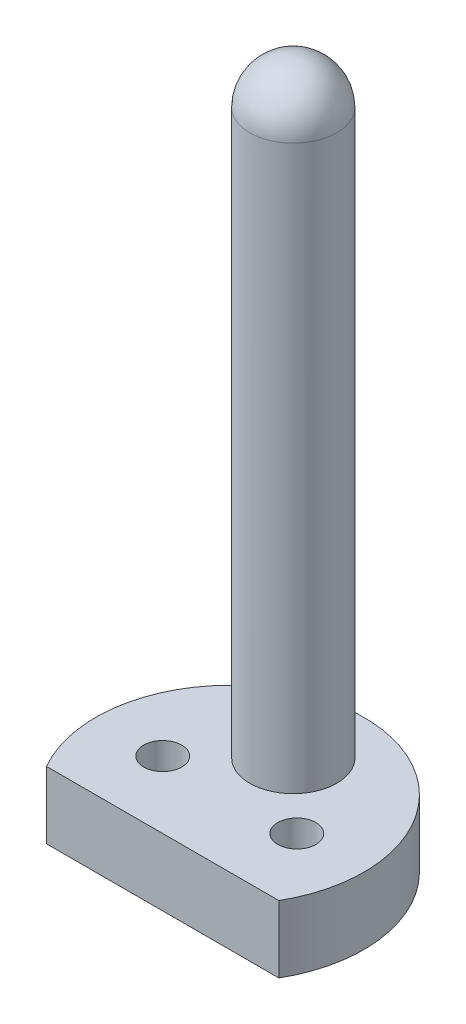
ISO-10303-21;
HEADER;
FILE_DESCRIPTION(('STEP AP214'),'2;1');
FILE_NAME('part.step','',(''),(''),'','','');
FILE_SCHEMA(('AUTOMOTIVE_DESIGN { 1 0 10303 214 1 1 1 1 }'));
ENDSEC;
DATA;
#1=APPLICATION_CONTEXT('core data for automotive mechanical design processes');
#2=APPLICATION_PROTOCOL_DEFINITION('international standard','automotive_design',2000,#1);
#3=PRODUCT_CONTEXT('',#1,'mechanical');
#4=PRODUCT('Part','Part','',(#3));
#5=PRODUCT_RELATED_PRODUCT_CATEGORY('part','',(#4));
#6=PRODUCT_DEFINITION_FORMATION('','',#4);
#7=PRODUCT_DEFINITION_CONTEXT('part definition',#1,'design');
#8=PRODUCT_DEFINITION('design','',#6,#7);
#9=PRODUCT_DEFINITION_SHAPE('','',#8);
#10=(LENGTH_UNIT() NAMED_UNIT(*) SI_UNIT(.MILLI.,.METRE.));
#11=(NAMED_UNIT(*) PLANE_ANGLE_UNIT() SI_UNIT($,.RADIAN.));
#12=(NAMED_UNIT(*) SI_UNIT($,.STERADIAN.) SOLID_ANGLE_UNIT());
#13=UNCERTAINTY_MEASURE_WITH_UNIT(LENGTH_MEASURE(1.E-05),#10,'distance_accuracy_value','');
#14=(GEOMETRIC_REPRESENTATION_CONTEXT(3) GLOBAL_UNCERTAINTY_ASSIGNED_CONTEXT((#13)) GLOBAL_UNIT_ASSIGNED_CONTEXT((#10,
#11,#12)) REPRESENTATION_CONTEXT('',''));
#15=CARTESIAN_POINT('',(0.,0.,0.));
#16=DIRECTION('',(0.,0.,1.));
#17=DIRECTION('',(1.,0.,0.));
#18=AXIS2_PLACEMENT_3D('',#15,#16,#17);
#19=CARTESIAN_POINT('',(0.,5.,0.));
#20=DIRECTION('',(0.,1.,0.));
#21=DIRECTION('',(0.,0.,1.));
#22=AXIS2_PLACEMENT_3D('',#19,#20,#21);
#23=PLANE('',#22);
#24=CARTESIAN_POINT('',(0.,5.,-4.73478223723896));
#25=DIRECTION('',(0.,1.,0.));
#26=DIRECTION('',(0.,0.,1.));
#27=AXIS2_PLACEMENT_3D('',#24,#25,#26);
#28=CIRCLE('',#27,3.25);
#29=CARTESIAN_POINT('',(0.,5.,-7.98478223723896));
#30=VERTEX_POINT('',#29);
#31=EDGE_CURVE('E89',#30,#30,#28,.T.);
#32=ORIENTED_EDGE('',*,*,#31,.F.);
#33=EDGE_LOOP('',(#32));
#34=FACE_BOUND('',#33,.T.);
#35=CARTESIAN_POINT('',(-5.,5.,0.));
#36=DIRECTION('',(0.,1.,0.));
#37=DIRECTION('',(0.,0.,1.));
#38=AXIS2_PLACEMENT_3D('',#35,#36,#37);
#39=CIRCLE('',#38,1.42);
#40=CARTESIAN_POINT('',(-5.,5.,1.42));
#41=VERTEX_POINT('',#40);
#42=EDGE_CURVE('E72',#41,#41,#39,.T.);
#43=ORIENTED_EDGE('',*,*,#42,.F.);
#44=EDGE_LOOP('',(#43));
#45=FACE_BOUND('',#44,.T.);
#46=CARTESIAN_POINT('',(0.,5.,0.));
#47=DIRECTION('',(0.,1.,0.));
#48=DIRECTION('',(0.,0.,1.));
#49=AXIS2_PLACEMENT_3D('',#46,#47,#48);
#50=CIRCLE('',#49,10.);
#51=CARTESIAN_POINT('',(8.66025403784439,5.,5.));
#52=VERTEX_POINT('',#51);
#53=CARTESIAN_POINT('',(-8.66025403784439,5.,5.));
#54=VERTEX_POINT('',#53);
#55=EDGE_CURVE('E66',#52,#54,#50,.T.);
#56=ORIENTED_EDGE('',*,*,#55,.T.);
#57=DIRECTION('',(1.,0.,0.));
#58=VECTOR('',#57,1.);
#59=CARTESIAN_POINT('',(-8.66025403784439,5.,5.));
#60=LINE('',#59,#58);
#61=EDGE_CURVE('E51',#54,#52,#60,.T.);
#62=ORIENTED_EDGE('',*,*,#61,.T.);
#63=EDGE_LOOP('',(#56,#62));
#64=FACE_BOUND('',#63,.T.);
#65=CARTESIAN_POINT('',(5.,5.,0.));
#66=DIRECTION('',(0.,1.,0.));
#67=DIRECTION('',(0.,0.,1.));
#68=AXIS2_PLACEMENT_3D('',#65,#66,#67);
#69=CIRCLE('',#68,1.42);
#70=CARTESIAN_POINT('',(5.,5.,1.42));
#71=VERTEX_POINT('',#70);
#72=EDGE_CURVE('E81',#71,#71,#69,.T.);
#73=ORIENTED_EDGE('',*,*,#72,.F.);
#74=EDGE_LOOP('',(#73));
#75=FACE_BOUND('',#74,.T.);
#76=ADVANCED_FACE('F35',(#34,#45,#64,#75),#23,.T.);
#77=CARTESIAN_POINT('',(0.,0.,0.));
#78=DIRECTION('',(0.,1.,0.));
#79=DIRECTION('',(0.,0.,1.));
#80=AXIS2_PLACEMENT_3D('',#77,#78,#79);
#81=PLANE('',#80);
#82=CARTESIAN_POINT('',(0.,0.,0.));
#83=DIRECTION('',(0.,1.,0.));
#84=DIRECTION('',(0.,0.,1.));
#85=AXIS2_PLACEMENT_3D('',#82,#83,#84);
#86=CIRCLE('',#85,10.);
#87=CARTESIAN_POINT('',(8.66025403784439,0.,5.));
#88=VERTEX_POINT('',#87);
#89=CARTESIAN_POINT('',(-8.66025403784439,0.,5.));
#90=VERTEX_POINT('',#89);
#91=EDGE_CURVE('E67',#88,#90,#86,.T.);
#92=ORIENTED_EDGE('',*,*,#91,.F.);
#93=DIRECTION('',(1.,0.,0.));
#94=VECTOR('',#93,1.);
#95=CARTESIAN_POINT('',(-8.66025403784439,0.,5.));
#96=LINE('',#95,#94);
#97=EDGE_CURVE('E59',#90,#88,#96,.T.);
#98=ORIENTED_EDGE('',*,*,#97,.F.);
#99=EDGE_LOOP('',(#92,#98));
#100=FACE_BOUND('',#99,.T.);
#101=CARTESIAN_POINT('',(-5.,0.,0.));
#102=DIRECTION('',(0.,1.,0.));
#103=DIRECTION('',(0.,0.,1.));
#104=AXIS2_PLACEMENT_3D('',#101,#102,#103);
#105=CIRCLE('',#104,1.42);
#106=CARTESIAN_POINT('',(-5.,0.,1.42));
#107=VERTEX_POINT('',#106);
#108=EDGE_CURVE('E75',#107,#107,#105,.T.);
#109=ORIENTED_EDGE('',*,*,#108,.T.);
#110=EDGE_LOOP('',(#109));
#111=FACE_BOUND('',#110,.T.);
#112=CARTESIAN_POINT('',(5.,0.,0.));
#113=DIRECTION('',(0.,1.,0.));
#114=DIRECTION('',(0.,0.,1.));
#115=AXIS2_PLACEMENT_3D('',#112,#113,#114);
#116=CIRCLE('',#115,1.42);
#117=CARTESIAN_POINT('',(5.,0.,1.42));
#118=VERTEX_POINT('',#117);
#119=EDGE_CURVE('E83',#118,#118,#116,.T.);
#120=ORIENTED_EDGE('',*,*,#119,.T.);
#121=EDGE_LOOP('',(#120));
#122=FACE_BOUND('',#121,.T.);
#123=ADVANCED_FACE('F70',(#100,#111,#122),#81,.F.);
#124=CARTESIAN_POINT('',(0.,5.,0.));
#125=DIRECTION('',(0.,-1.,0.));
#126=DIRECTION('',(0.,0.,-1.));
#127=AXIS2_PLACEMENT_3D('',#124,#125,#126);
#128=CYLINDRICAL_SURFACE('',#127,10.);
#129=ORIENTED_EDGE('',*,*,#91,.T.);
#130=DIRECTION('',(0.,-1.,0.));
#131=VECTOR('',#130,1.);
#132=CARTESIAN_POINT('',(-8.66025403784439,5.,5.));
#133=LINE('',#132,#131);
#134=EDGE_CURVE('E11',#54,#90,#133,.T.);
#135=ORIENTED_EDGE('',*,*,#134,.F.);
#136=ORIENTED_EDGE('',*,*,#55,.F.);
#137=DIRECTION('',(0.,-1.,0.));
#138=VECTOR('',#137,1.);
#139=CARTESIAN_POINT('',(8.66025403784439,5.,5.));
#140=LINE('',#139,#138);
#141=EDGE_CURVE('E44',#52,#88,#140,.T.);
#142=ORIENTED_EDGE('',*,*,#141,.T.);
#143=EDGE_LOOP('',(#129,#135,#136,#142));
#144=FACE_BOUND('',#143,.T.);
#145=ADVANCED_FACE('F37',(#144),#128,.T.);
#146=CARTESIAN_POINT('',(-8.66025403784439,5.,5.));
#147=DIRECTION('',(0.,0.,-1.));
#148=DIRECTION('',(-1.,0.,0.));
#149=AXIS2_PLACEMENT_3D('',#146,#147,#148);
#150=PLANE('',#149);
#151=ORIENTED_EDGE('',*,*,#97,.T.);
#152=ORIENTED_EDGE('',*,*,#141,.F.);
#153=ORIENTED_EDGE('',*,*,#61,.F.);
#154=ORIENTED_EDGE('',*,*,#134,.T.);
#155=EDGE_LOOP('',(#151,#152,#153,#154));
#156=FACE_BOUND('',#155,.T.);
#157=ADVANCED_FACE('F62',(#156),#150,.F.);
#158=CARTESIAN_POINT('',(-5.,5.,0.));
#159=DIRECTION('',(0.,-1.,0.));
#160=DIRECTION('',(0.,0.,-1.));
#161=AXIS2_PLACEMENT_3D('',#158,#159,#160);
#162=CYLINDRICAL_SURFACE('',#161,1.42);
#163=ORIENTED_EDGE('',*,*,#42,.T.);
#164=EDGE_LOOP('',(#163));
#165=FACE_BOUND('',#164,.T.);
#166=ORIENTED_EDGE('',*,*,#108,.F.);
#167=EDGE_LOOP('',(#166));
#168=FACE_BOUND('',#167,.T.);
#169=ADVANCED_FACE('F113',(#165,#168),#162,.F.);
#170=CARTESIAN_POINT('',(5.,5.,0.));
#171=DIRECTION('',(0.,-1.,0.));
#172=DIRECTION('',(0.,0.,-1.));
#173=AXIS2_PLACEMENT_3D('',#170,#171,#172);
#174=CYLINDRICAL_SURFACE('',#173,1.42);
#175=ORIENTED_EDGE('',*,*,#72,.T.);
#176=EDGE_LOOP('',(#175));
#177=FACE_BOUND('',#176,.T.);
#178=ORIENTED_EDGE('',*,*,#119,.F.);
#179=EDGE_LOOP('',(#178));
#180=FACE_BOUND('',#179,.T.);
#181=ADVANCED_FACE('F100',(#177,#180),#174,.F.);
#182=CARTESIAN_POINT('',(0.,47.,-4.73478223723896));
#183=DIRECTION('',(0.,-1.,0.));
#184=DIRECTION('',(0.,0.,-1.));
#185=AXIS2_PLACEMENT_3D('',#182,#183,#184);
#186=CYLINDRICAL_SURFACE('',#185,3.25);
#187=CARTESIAN_POINT('',(0.,47.,-4.73478223723896));
#188=DIRECTION('',(0.,1.,0.));
#189=DIRECTION('',(0.,0.,1.));
#190=AXIS2_PLACEMENT_3D('',#187,#188,#189);
#191=CIRCLE('',#190,3.25);
#192=CARTESIAN_POINT('',(0.,47.,-7.98478223723896));
#193=VERTEX_POINT('',#192);
#194=EDGE_CURVE('E86',#193,#193,#191,.T.);
#195=CARTESIAN_POINT('',(0.,47.,-7.98478223723896));
#196=CARTESIAN_POINT('',(0.,46.5625,-7.98478223723896));
#197=CARTESIAN_POINT('',(0.,46.125,-7.98478223723896));
#198=CARTESIAN_POINT('',(0.,45.25,-7.98478223723896));
#199=CARTESIAN_POINT('',(0.,44.8125,-7.98478223723896));
#200=CARTESIAN_POINT('',(0.,43.9375,-7.98478223723896));
#201=CARTESIAN_POINT('',(0.,43.5,-7.98478223723896));
#202=CARTESIAN_POINT('',(0.,42.625,-7.98478223723896));
#203=CARTESIAN_POINT('',(0.,42.1875,-7.98478223723896));
#204=CARTESIAN_POINT('',(0.,41.3125,-7.98478223723896));
#205=CARTESIAN_POINT('',(0.,40.875,-7.98478223723896));
#206=CARTESIAN_POINT('',(0.,40.,-7.98478223723896));
#207=CARTESIAN_POINT('',(0.,39.5625,-7.98478223723896));
#208=CARTESIAN_POINT('',(0.,38.6875,-7.98478223723896));
#209=CARTESIAN_POINT('',(0.,38.25,-7.98478223723896));
#210=CARTESIAN_POINT('',(0.,37.375,-7.98478223723896));
#211=CARTESIAN_POINT('',(0.,36.9375,-7.98478223723896));
#212=CARTESIAN_POINT('',(0.,36.0625,-7.98478223723896));
#213=CARTESIAN_POINT('',(0.,35.625,-7.98478223723896));
#214=CARTESIAN_POINT('',(0.,34.75,-7.98478223723896));
#215=CARTESIAN_POINT('',(0.,34.3125,-7.98478223723896));
#216=CARTESIAN_POINT('',(0.,33.4375,-7.98478223723896));
#217=CARTESIAN_POINT('',(0.,33.,-7.98478223723896));
#218=CARTESIAN_POINT('',(0.,32.125,-7.98478223723896));
#219=CARTESIAN_POINT('',(0.,31.6875,-7.98478223723896));
#220=CARTESIAN_POINT('',(0.,30.8125,-7.98478223723896));
#221=CARTESIAN_POINT('',(0.,30.375,-7.98478223723896));
#222=CARTESIAN_POINT('',(0.,29.5,-7.98478223723896));
#223=CARTESIAN_POINT('',(0.,29.0625,-7.98478223723896));
#224=CARTESIAN_POINT('',(0.,28.1875,-7.98478223723896));
#225=CARTESIAN_POINT('',(0.,27.75,-7.98478223723896));
#226=CARTESIAN_POINT('',(0.,26.875,-7.98478223723896));
#227=CARTESIAN_POINT('',(0.,26.4375,-7.98478223723896));
#228=CARTESIAN_POINT('',(0.,25.5625,-7.98478223723896));
#229=CARTESIAN_POINT('',(0.,25.125,-7.98478223723896));
#230=CARTESIAN_POINT('',(0.,24.25,-7.98478223723896));
#231=CARTESIAN_POINT('',(0.,23.8125,-7.98478223723896));
#232=CARTESIAN_POINT('',(0.,22.9375,-7.98478223723896));
#233=CARTESIAN_POINT('',(0.,22.5,-7.98478223723896));
#234=CARTESIAN_POINT('',(0.,21.625,-7.98478223723896));
#235=CARTESIAN_POINT('',(0.,21.1875,-7.98478223723896));
#236=CARTESIAN_POINT('',(0.,20.3125,-7.98478223723896));
#237=CARTESIAN_POINT('',(0.,19.875,-7.98478223723896));
#238=CARTESIAN_POINT('',(0.,19.,-7.98478223723896));
#239=CARTESIAN_POINT('',(0.,18.5625,-7.98478223723896));
#240=CARTESIAN_POINT('',(0.,17.6875,-7.98478223723896));
#241=CARTESIAN_POINT('',(0.,17.25,-7.98478223723896));
#242=CARTESIAN_POINT('',(0.,16.375,-7.98478223723896));
#243=CARTESIAN_POINT('',(0.,15.9375,-7.98478223723896));
#244=CARTESIAN_POINT('',(0.,15.0625,-7.98478223723896));
#245=CARTESIAN_POINT('',(0.,14.625,-7.98478223723896));
#246=CARTESIAN_POINT('',(0.,13.75,-7.98478223723896));
#247=CARTESIAN_POINT('',(0.,13.3125,-7.98478223723896));
#248=CARTESIAN_POINT('',(0.,12.4375,-7.98478223723896));
#249=CARTESIAN_POINT('',(0.,12.,-7.98478223723896));
#250=CARTESIAN_POINT('',(0.,11.125,-7.98478223723896));
#251=CARTESIAN_POINT('',(0.,10.6875,-7.98478223723896));
#252=CARTESIAN_POINT('',(0.,9.8125,-7.98478223723896));
#253=CARTESIAN_POINT('',(0.,9.375,-7.98478223723896));
#254=CARTESIAN_POINT('',(0.,8.5,-7.98478223723896));
#255=CARTESIAN_POINT('',(0.,8.0625,-7.98478223723896));
#256=CARTESIAN_POINT('',(0.,7.1875,-7.98478223723896));
#257=CARTESIAN_POINT('',(0.,6.75,-7.98478223723896));
#258=CARTESIAN_POINT('',(0.,5.875,-7.98478223723896));
#259=CARTESIAN_POINT('',(0.,5.4375,-7.98478223723896));
#260=CARTESIAN_POINT('',(0.,5.,-7.98478223723896));
#261=B_SPLINE_CURVE_WITH_KNOTS('',3,(#195,#196,#197,#198,#199,#200,#201,#202,#203,#204,#205,
#206,#207,#208,#209,#210,#211,#212,#213,#214,#215,#216,#217,#218,#219,#220,#221,#222,#223,#224,
#225,#226,#227,#228,#229,#230,#231,#232,#233,#234,#235,#236,#237,#238,#239,#240,#241,#242,#243,
#244,#245,#246,#247,#248,#249,#250,#251,#252,#253,#254,#255,#256,#257,#258,#259,#260),
.UNSPECIFIED.,.F.,.F.,(4,2,2,2,2,2,2,2,2,2,2,2,2,2,2,2,2,2,2,2,2,2,2,2,2,2,2,2,2,2,2,2,4),(0.,
1.31249999999999,2.625,3.9375,5.25,6.5625,7.87499999999999,9.18749999999999,10.5,11.8125,13.125,
14.4375,15.75,17.0625,18.375,19.6875,21.,22.3125,23.625,24.9375,26.25,27.5625,28.875,30.1875,
31.5,32.8125,34.125,35.4375,36.75,38.0625,39.375,40.6875,42.),.UNSPECIFIED.);
#262=EDGE_CURVE('BSEAM97',#193,#30,#261,.T.);
#263=ORIENTED_EDGE('',*,*,#194,.F.);
#264=ORIENTED_EDGE('',*,*,#31,.T.);
#265=ORIENTED_EDGE('',*,*,#262,.T.);
#266=ORIENTED_EDGE('',*,*,#262,.F.);
#267=EDGE_LOOP('',(#263,#265,#264,#266));
#268=FACE_BOUND('',#267,.T.);
#269=ADVANCED_FACE('F97',(#268),#186,.T.);
#270=CARTESIAN_POINT('',(0.,47.,-4.73478223723896));
#271=DIRECTION('',(0.,0.,-1.));
#272=DIRECTION('',(-1.,0.,0.));
#273=AXIS2_PLACEMENT_3D('',#270,#271,#272);
#274=SPHERICAL_SURFACE('',#273,3.25);
#275=CARTESIAN_POINT('',(0.,47.,-4.73478223723896));
#276=DIRECTION('',(0.,1.,0.));
#277=DIRECTION('',(0.,0.,1.));
#278=AXIS2_PLACEMENT_3D('',#275,#276,#277);
#279=SPHERICAL_SURFACE('',#278,3.25);
#280=ORIENTED_EDGE('',*,*,#194,.T.);
#281=EDGE_LOOP('',(#280));
#282=FACE_BOUND('',#281,.T.);
#283=ADVANCED_FACE('F95',(#282),#279,.T.);
#284=CLOSED_SHELL('',(#76,#123,#145,#157,#169,#181,#269,#283));
#285=MANIFOLD_SOLID_BREP('B2',#284);
#286=ADVANCED_BREP_SHAPE_REPRESENTATION('',(#18,#285),#14);
#287=SHAPE_DEFINITION_REPRESENTATION(#9,#286);
ENDSEC;
END-ISO-10303-21;
